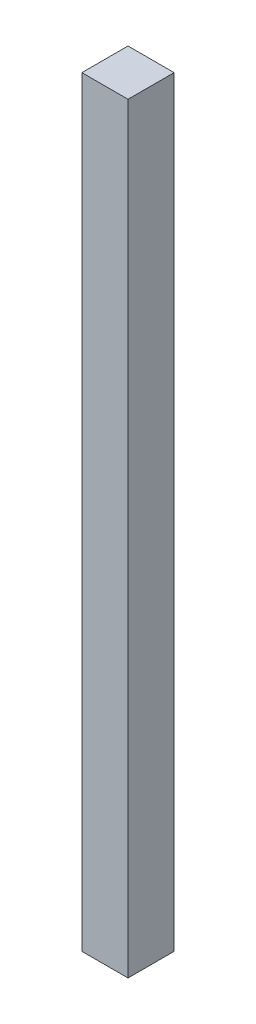
ISO-10303-21;
HEADER;
FILE_DESCRIPTION(('STEP AP214'),'2;1');
FILE_NAME('part.step','',(''),(''),'','','');
FILE_SCHEMA(('AUTOMOTIVE_DESIGN { 1 0 10303 214 1 1 1 1 }'));
ENDSEC;
DATA;
#1=APPLICATION_CONTEXT('core data for automotive mechanical design processes');
#2=APPLICATION_PROTOCOL_DEFINITION('international standard','automotive_design',2000,#1);
#3=PRODUCT_CONTEXT('',#1,'mechanical');
#4=PRODUCT('Part','Part','',(#3));
#5=PRODUCT_RELATED_PRODUCT_CATEGORY('part','',(#4));
#6=PRODUCT_DEFINITION_FORMATION('','',#4);
#7=PRODUCT_DEFINITION_CONTEXT('part definition',#1,'design');
#8=PRODUCT_DEFINITION('design','',#6,#7);
#9=PRODUCT_DEFINITION_SHAPE('','',#8);
#10=(LENGTH_UNIT() NAMED_UNIT(*) SI_UNIT(.MILLI.,.METRE.));
#11=(NAMED_UNIT(*) PLANE_ANGLE_UNIT() SI_UNIT($,.RADIAN.));
#12=(NAMED_UNIT(*) SI_UNIT($,.STERADIAN.) SOLID_ANGLE_UNIT());
#13=UNCERTAINTY_MEASURE_WITH_UNIT(LENGTH_MEASURE(1.E-05),#10,'distance_accuracy_value','');
#14=(GEOMETRIC_REPRESENTATION_CONTEXT(3) GLOBAL_UNCERTAINTY_ASSIGNED_CONTEXT((#13)) GLOBAL_UNIT_ASSIGNED_CONTEXT((#10,
#11,#12)) REPRESENTATION_CONTEXT('',''));
#15=CARTESIAN_POINT('',(0.,0.,0.));
#16=DIRECTION('',(0.,0.,1.));
#17=DIRECTION('',(1.,0.,0.));
#18=AXIS2_PLACEMENT_3D('',#15,#16,#17);
#19=CARTESIAN_POINT('',(0.2499995,4.12503874,0.));
#20=DIRECTION('',(1.,0.,0.));
#21=DIRECTION('',(0.,0.,-1.));
#22=AXIS2_PLACEMENT_3D('',#19,#20,#21);
#23=PLANE('',#22);
#24=DIRECTION('',(0.,0.,-1.));
#25=VECTOR('',#24,1.);
#26=CARTESIAN_POINT('',(0.2499995,-4.12503874,0.));
#27=LINE('',#26,#25);
#28=CARTESIAN_POINT('',(0.2499995,-4.12503874,0.));
#29=VERTEX_POINT('',#28);
#30=CARTESIAN_POINT('',(0.2499995,-4.12503874,0.499999));
#31=VERTEX_POINT('',#30);
#32=EDGE_CURVE('E20',#29,#31,#27,.F.);
#33=ORIENTED_EDGE('',*,*,#32,.F.);
#34=DIRECTION('',(0.,1.,0.));
#35=VECTOR('',#34,1.);
#36=CARTESIAN_POINT('',(0.2499995,-4.12503874,0.));
#37=LINE('',#36,#35);
#38=CARTESIAN_POINT('',(0.2499995,4.12503874,0.));
#39=VERTEX_POINT('',#38);
#40=EDGE_CURVE('E79',#29,#39,#37,.T.);
#41=ORIENTED_EDGE('',*,*,#40,.T.);
#42=DIRECTION('',(0.,0.,1.));
#43=VECTOR('',#42,1.);
#44=CARTESIAN_POINT('',(0.2499995,4.12503874,0.));
#45=LINE('',#44,#43);
#46=CARTESIAN_POINT('',(0.2499995,4.12503874,0.499999));
#47=VERTEX_POINT('',#46);
#48=EDGE_CURVE('E61',#47,#39,#45,.F.);
#49=ORIENTED_EDGE('',*,*,#48,.F.);
#50=DIRECTION('',(0.,1.,0.));
#51=VECTOR('',#50,1.);
#52=CARTESIAN_POINT('',(0.2499995,-4.12503874,0.499999));
#53=LINE('',#52,#51);
#54=EDGE_CURVE('E56',#31,#47,#53,.T.);
#55=ORIENTED_EDGE('',*,*,#54,.F.);
#56=EDGE_LOOP('',(#33,#41,#49,#55));
#57=FACE_BOUND('',#56,.T.);
#58=ADVANCED_FACE('F17',(#57),#23,.T.);
#59=CARTESIAN_POINT('',(0.2499995,-4.12503874,0.));
#60=DIRECTION('',(0.,-1.,0.));
#61=DIRECTION('',(0.,0.,-1.));
#62=AXIS2_PLACEMENT_3D('',#59,#60,#61);
#63=PLANE('',#62);
#64=DIRECTION('',(0.,0.,1.));
#65=VECTOR('',#64,1.);
#66=CARTESIAN_POINT('',(-0.2499995,-4.12503874,0.));
#67=LINE('',#66,#65);
#68=CARTESIAN_POINT('',(-0.2499995,-4.12503874,0.));
#69=VERTEX_POINT('',#68);
#70=CARTESIAN_POINT('',(-0.2499995,-4.12503874,0.499999));
#71=VERTEX_POINT('',#70);
#72=EDGE_CURVE('E83',#69,#71,#67,.T.);
#73=ORIENTED_EDGE('',*,*,#72,.F.);
#74=DIRECTION('',(1.,0.,0.));
#75=VECTOR('',#74,1.);
#76=CARTESIAN_POINT('',(0.2499995,-4.12503874,0.));
#77=LINE('',#76,#75);
#78=EDGE_CURVE('E68',#69,#29,#77,.T.);
#79=ORIENTED_EDGE('',*,*,#78,.T.);
#80=ORIENTED_EDGE('',*,*,#32,.T.);
#81=DIRECTION('',(1.,0.,0.));
#82=VECTOR('',#81,1.);
#83=CARTESIAN_POINT('',(0.2499995,-4.12503874,0.499999));
#84=LINE('',#83,#82);
#85=EDGE_CURVE('E63',#71,#31,#84,.T.);
#86=ORIENTED_EDGE('',*,*,#85,.F.);
#87=EDGE_LOOP('',(#73,#79,#80,#86));
#88=FACE_BOUND('',#87,.T.);
#89=ADVANCED_FACE('F65',(#88),#63,.T.);
#90=CARTESIAN_POINT('',(0.2499995,-4.12503874,0.499999));
#91=DIRECTION('',(0.,0.,1.));
#92=DIRECTION('',(1.,0.,0.));
#93=AXIS2_PLACEMENT_3D('',#90,#91,#92);
#94=PLANE('',#93);
#95=DIRECTION('',(0.,1.,0.));
#96=VECTOR('',#95,1.);
#97=CARTESIAN_POINT('',(-0.2499995,-4.12503874,0.499999));
#98=LINE('',#97,#96);
#99=CARTESIAN_POINT('',(-0.2499995,4.12503874,0.499999));
#100=VERTEX_POINT('',#99);
#101=EDGE_CURVE('E72',#71,#100,#98,.T.);
#102=ORIENTED_EDGE('',*,*,#101,.F.);
#103=ORIENTED_EDGE('',*,*,#85,.T.);
#104=ORIENTED_EDGE('',*,*,#54,.T.);
#105=DIRECTION('',(1.,0.,0.));
#106=VECTOR('',#105,1.);
#107=CARTESIAN_POINT('',(-0.2499995,4.12503874,0.499999));
#108=LINE('',#107,#106);
#109=EDGE_CURVE('E74',#100,#47,#108,.T.);
#110=ORIENTED_EDGE('',*,*,#109,.F.);
#111=EDGE_LOOP('',(#102,#103,#104,#110));
#112=FACE_BOUND('',#111,.T.);
#113=ADVANCED_FACE('F70',(#112),#94,.T.);
#114=CARTESIAN_POINT('',(-0.2499995,4.12503874,0.));
#115=DIRECTION('',(0.,1.,0.));
#116=DIRECTION('',(0.,0.,1.));
#117=AXIS2_PLACEMENT_3D('',#114,#115,#116);
#118=PLANE('',#117);
#119=ORIENTED_EDGE('',*,*,#48,.T.);
#120=DIRECTION('',(1.,0.,0.));
#121=VECTOR('',#120,1.);
#122=CARTESIAN_POINT('',(0.2499995,4.12503874,0.));
#123=LINE('',#122,#121);
#124=CARTESIAN_POINT('',(-0.2499995,4.12503874,0.));
#125=VERTEX_POINT('',#124);
#126=EDGE_CURVE('E35',#39,#125,#123,.F.);
#127=ORIENTED_EDGE('',*,*,#126,.T.);
#128=DIRECTION('',(0.,0.,1.));
#129=VECTOR('',#128,1.);
#130=CARTESIAN_POINT('',(-0.2499995,4.12503874,0.));
#131=LINE('',#130,#129);
#132=EDGE_CURVE('E26',#100,#125,#131,.F.);
#133=ORIENTED_EDGE('',*,*,#132,.F.);
#134=ORIENTED_EDGE('',*,*,#109,.T.);
#135=EDGE_LOOP('',(#119,#127,#133,#134));
#136=FACE_BOUND('',#135,.T.);
#137=ADVANCED_FACE('F89',(#136),#118,.T.);
#138=CARTESIAN_POINT('',(0.2499995,-4.12503874,0.));
#139=DIRECTION('',(0.,0.,1.));
#140=DIRECTION('',(1.,0.,0.));
#141=AXIS2_PLACEMENT_3D('',#138,#139,#140);
#142=PLANE('',#141);
#143=DIRECTION('',(0.,1.,0.));
#144=VECTOR('',#143,1.);
#145=CARTESIAN_POINT('',(-0.2499995,-4.12503874,0.));
#146=LINE('',#145,#144);
#147=EDGE_CURVE('E11',#125,#69,#146,.F.);
#148=ORIENTED_EDGE('',*,*,#147,.F.);
#149=ORIENTED_EDGE('',*,*,#126,.F.);
#150=ORIENTED_EDGE('',*,*,#40,.F.);
#151=ORIENTED_EDGE('',*,*,#78,.F.);
#152=EDGE_LOOP('',(#148,#149,#150,#151));
#153=FACE_BOUND('',#152,.T.);
#154=ADVANCED_FACE('F91',(#153),#142,.F.);
#155=CARTESIAN_POINT('',(-0.2499995,-4.12503874,0.));
#156=DIRECTION('',(-1.,0.,0.));
#157=DIRECTION('',(0.,0.,1.));
#158=AXIS2_PLACEMENT_3D('',#155,#156,#157);
#159=PLANE('',#158);
#160=ORIENTED_EDGE('',*,*,#132,.T.);
#161=ORIENTED_EDGE('',*,*,#147,.T.);
#162=ORIENTED_EDGE('',*,*,#72,.T.);
#163=ORIENTED_EDGE('',*,*,#101,.T.);
#164=EDGE_LOOP('',(#160,#161,#162,#163));
#165=FACE_BOUND('',#164,.T.);
#166=ADVANCED_FACE('F88',(#165),#159,.T.);
#167=CLOSED_SHELL('',(#58,#89,#113,#137,#154,#166));
#168=MANIFOLD_SOLID_BREP('B1',#167);
#169=ADVANCED_BREP_SHAPE_REPRESENTATION('',(#18,#168),#14);
#170=SHAPE_DEFINITION_REPRESENTATION(#9,#169);
ENDSEC;
END-ISO-10303-21;
